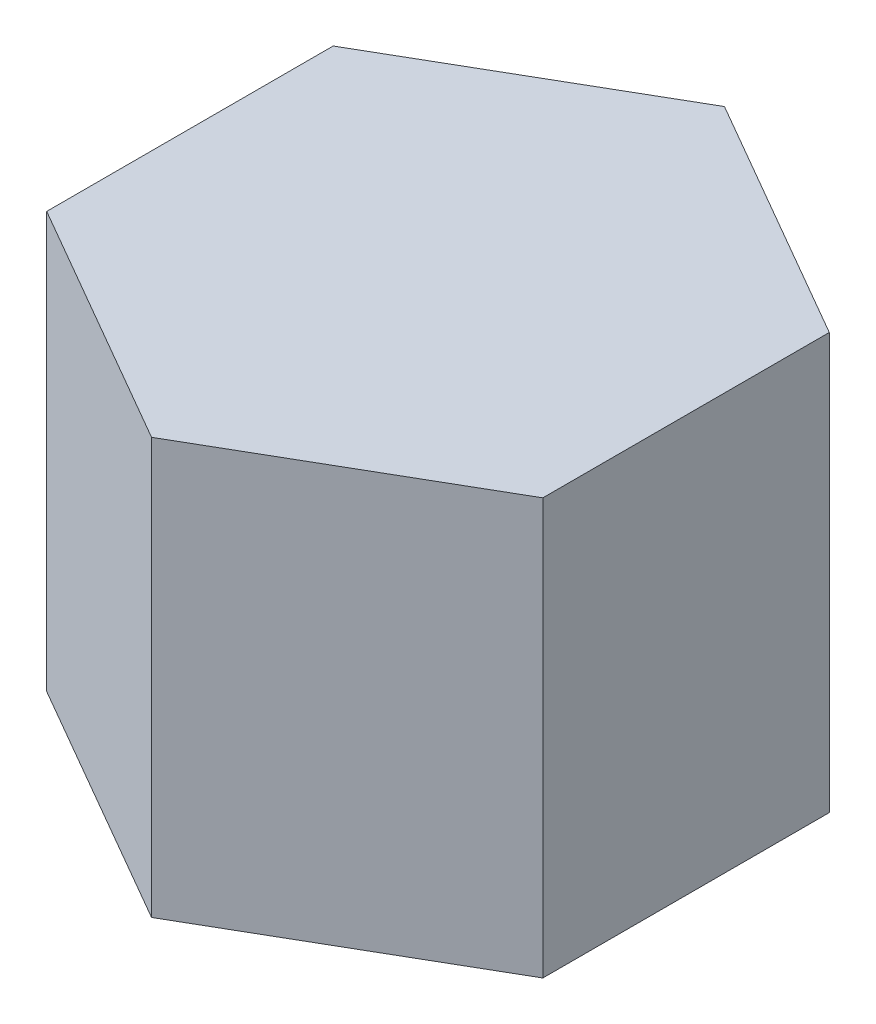
ISO-10303-21;
HEADER;
FILE_DESCRIPTION(('STEP AP214'),'2;1');
FILE_NAME('part.step','',(''),(''),'','','');
FILE_SCHEMA(('AUTOMOTIVE_DESIGN { 1 0 10303 214 1 1 1 1 }'));
ENDSEC;
DATA;
#1=APPLICATION_CONTEXT('core data for automotive mechanical design processes');
#2=APPLICATION_PROTOCOL_DEFINITION('international standard','automotive_design',2000,#1);
#3=PRODUCT_CONTEXT('',#1,'mechanical');
#4=PRODUCT('Part','Part','',(#3));
#5=PRODUCT_RELATED_PRODUCT_CATEGORY('part','',(#4));
#6=PRODUCT_DEFINITION_FORMATION('','',#4);
#7=PRODUCT_DEFINITION_CONTEXT('part definition',#1,'design');
#8=PRODUCT_DEFINITION('design','',#6,#7);
#9=PRODUCT_DEFINITION_SHAPE('','',#8);
#10=(LENGTH_UNIT() NAMED_UNIT(*) SI_UNIT(.MILLI.,.METRE.));
#11=(NAMED_UNIT(*) PLANE_ANGLE_UNIT() SI_UNIT($,.RADIAN.));
#12=(NAMED_UNIT(*) SI_UNIT($,.STERADIAN.) SOLID_ANGLE_UNIT());
#13=UNCERTAINTY_MEASURE_WITH_UNIT(LENGTH_MEASURE(1.E-05),#10,'distance_accuracy_value','');
#14=(GEOMETRIC_REPRESENTATION_CONTEXT(3) GLOBAL_UNCERTAINTY_ASSIGNED_CONTEXT((#13)) GLOBAL_UNIT_ASSIGNED_CONTEXT((#10,
#11,#12)) REPRESENTATION_CONTEXT('',''));
#15=CARTESIAN_POINT('',(0.,0.,0.));
#16=DIRECTION('',(0.,0.,1.));
#17=DIRECTION('',(1.,0.,0.));
#18=AXIS2_PLACEMENT_3D('',#15,#16,#17);
#19=CARTESIAN_POINT('',(206.142660308706,-148.537700895744,292.372996624279));
#20=DIRECTION('',(-0.499999999999909,0.,-0.866025403784491));
#21=DIRECTION('',(-0.866025403784491,0.,0.499999999999909));
#22=AXIS2_PLACEMENT_3D('',#19,#20,#21);
#23=PLANE('',#22);
#24=CARTESIAN_POINT('',(205.839551417382,-149.045793579175,292.547996624279));
#25=DIRECTION('',(0.866025403784491,0.,-0.499999999999909));
#26=VECTOR('',#25,1.);
#27=LINE('',#24,#26);
#28=CARTESIAN_POINT('',(205.839551417382,-149.045793579175,292.547996624279));
#29=VERTEX_POINT('',#28);
#30=CARTESIAN_POINT('',(206.142660308706,-149.045793579175,292.372996624279));
#31=VERTEX_POINT('',#30);
#32=EDGE_CURVE('E170',#29,#31,#27,.T.);
#33=ORIENTED_EDGE('',*,*,#32,.T.);
#34=CARTESIAN_POINT('',(206.142660308706,-148.537700895744,292.372996624279));
#35=DIRECTION('',(0.,-1.,0.));
#36=VECTOR('',#35,1.);
#37=LINE('',#34,#36);
#38=CARTESIAN_POINT('',(206.142660308706,-148.537700895744,292.372996624279));
#39=VERTEX_POINT('',#38);
#40=EDGE_CURVE('E35',#39,#31,#37,.T.);
#41=ORIENTED_EDGE('',*,*,#40,.F.);
#42=CARTESIAN_POINT('',(205.839551417382,-148.537700895744,292.547996624279));
#43=DIRECTION('',(0.866025403784491,0.,-0.499999999999909));
#44=VECTOR('',#43,1.);
#45=LINE('',#42,#44);
#46=CARTESIAN_POINT('',(205.839551417382,-148.537700895744,292.547996624279));
#47=VERTEX_POINT('',#46);
#48=EDGE_CURVE('E159',#47,#39,#45,.T.);
#49=ORIENTED_EDGE('',*,*,#48,.F.);
#50=CARTESIAN_POINT('',(205.839551417382,-148.537700895744,292.547996624279));
#51=DIRECTION('',(0.,-1.,0.));
#52=VECTOR('',#51,1.);
#53=LINE('',#50,#52);
#54=EDGE_CURVE('E10',#47,#29,#53,.T.);
#55=ORIENTED_EDGE('',*,*,#54,.T.);
#56=EDGE_LOOP('',(#33,#41,#49,#55));
#57=FACE_BOUND('',#56,.T.);
#58=ADVANCED_FACE('F16',(#57),#23,.F.);
#59=CARTESIAN_POINT('',(205.839551417382,-148.537700895744,292.547996624279));
#60=DIRECTION('',(0.500000000000062,0.,-0.866025403784403));
#61=DIRECTION('',(-0.866025403784403,0.,-0.500000000000062));
#62=AXIS2_PLACEMENT_3D('',#59,#60,#61);
#63=PLANE('',#62);
#64=CARTESIAN_POINT('',(205.536442526057,-149.045793579175,292.372996624279));
#65=DIRECTION('',(0.866025403784403,0.,0.500000000000062));
#66=VECTOR('',#65,1.);
#67=LINE('',#64,#66);
#68=CARTESIAN_POINT('',(205.536442526057,-149.045793579175,292.372996624279));
#69=VERTEX_POINT('',#68);
#70=EDGE_CURVE('E167',#69,#29,#67,.T.);
#71=ORIENTED_EDGE('',*,*,#70,.T.);
#72=ORIENTED_EDGE('',*,*,#54,.F.);
#73=CARTESIAN_POINT('',(205.536442526057,-148.537700895744,292.372996624279));
#74=DIRECTION('',(0.866025403784403,0.,0.500000000000062));
#75=VECTOR('',#74,1.);
#76=LINE('',#73,#75);
#77=CARTESIAN_POINT('',(205.536442526057,-148.537700895744,292.372996624279));
#78=VERTEX_POINT('',#77);
#79=EDGE_CURVE('E156',#78,#47,#76,.T.);
#80=ORIENTED_EDGE('',*,*,#79,.F.);
#81=CARTESIAN_POINT('',(205.536442526057,-148.537700895744,292.372996624279));
#82=DIRECTION('',(0.,-1.,0.));
#83=VECTOR('',#82,1.);
#84=LINE('',#81,#83);
#85=EDGE_CURVE('E27',#78,#69,#84,.T.);
#86=ORIENTED_EDGE('',*,*,#85,.T.);
#87=EDGE_LOOP('',(#71,#72,#80,#86));
#88=FACE_BOUND('',#87,.T.);
#89=ADVANCED_FACE('F189',(#88),#63,.F.);
#90=CARTESIAN_POINT('',(205.536442526057,-148.537700895744,290.831971220494));
#91=DIRECTION('',(1.,0.,0.));
#92=DIRECTION('',(0.,1.,0.));
#93=AXIS2_PLACEMENT_3D('',#90,#91,#92);
#94=PLANE('',#93);
#95=CARTESIAN_POINT('',(205.536442526057,-149.045793579175,292.022996624279));
#96=DIRECTION('',(0.,0.,1.));
#97=VECTOR('',#96,1.);
#98=LINE('',#95,#97);
#99=CARTESIAN_POINT('',(205.536442526057,-149.045793579175,292.022996624279));
#100=VERTEX_POINT('',#99);
#101=EDGE_CURVE('E163',#100,#69,#98,.T.);
#102=ORIENTED_EDGE('',*,*,#101,.T.);
#103=ORIENTED_EDGE('',*,*,#85,.F.);
#104=CARTESIAN_POINT('',(205.536442526057,-148.537700895744,292.022996624279));
#105=DIRECTION('',(0.,0.,1.));
#106=VECTOR('',#105,1.);
#107=LINE('',#104,#106);
#108=CARTESIAN_POINT('',(205.536442526057,-148.537700895744,292.022996624279));
#109=VERTEX_POINT('',#108);
#110=EDGE_CURVE('E106',#109,#78,#107,.T.);
#111=ORIENTED_EDGE('',*,*,#110,.F.);
#112=CARTESIAN_POINT('',(205.536442526057,-148.537700895744,292.022996624279));
#113=DIRECTION('',(0.,-1.,0.));
#114=VECTOR('',#113,1.);
#115=LINE('',#112,#114);
#116=EDGE_CURVE('E94',#109,#100,#115,.T.);
#117=ORIENTED_EDGE('',*,*,#116,.T.);
#118=EDGE_LOOP('',(#102,#103,#111,#117));
#119=FACE_BOUND('',#118,.T.);
#120=ADVANCED_FACE('F198',(#119),#94,.F.);
#121=CARTESIAN_POINT('',(205.536442526057,-148.537700895744,292.022996624279));
#122=DIRECTION('',(0.499999999999943,0.,0.866025403784472));
#123=DIRECTION('',(0.866025403784472,0.,-0.499999999999943));
#124=AXIS2_PLACEMENT_3D('',#121,#122,#123);
#125=PLANE('',#124);
#126=CARTESIAN_POINT('',(205.839551417382,-149.045793579175,291.847996624279));
#127=DIRECTION('',(-0.866025403784471,0.,0.499999999999943));
#128=VECTOR('',#127,1.);
#129=LINE('',#126,#128);
#130=CARTESIAN_POINT('',(205.839551417382,-149.045793579175,291.847996624279));
#131=VERTEX_POINT('',#130);
#132=EDGE_CURVE('E162',#131,#100,#129,.T.);
#133=ORIENTED_EDGE('',*,*,#132,.T.);
#134=ORIENTED_EDGE('',*,*,#116,.F.);
#135=CARTESIAN_POINT('',(205.839551417382,-148.537700895744,291.847996624279));
#136=DIRECTION('',(-0.866025403784471,0.,0.499999999999943));
#137=VECTOR('',#136,1.);
#138=LINE('',#135,#137);
#139=CARTESIAN_POINT('',(205.839551417382,-148.537700895744,291.847996624279));
#140=VERTEX_POINT('',#139);
#141=EDGE_CURVE('E98',#140,#109,#138,.T.);
#142=ORIENTED_EDGE('',*,*,#141,.F.);
#143=CARTESIAN_POINT('',(205.839551417382,-148.537700895744,291.847996624279));
#144=DIRECTION('',(0.,-1.,0.));
#145=VECTOR('',#144,1.);
#146=LINE('',#143,#145);
#147=EDGE_CURVE('E79',#140,#131,#146,.T.);
#148=ORIENTED_EDGE('',*,*,#147,.T.);
#149=EDGE_LOOP('',(#133,#134,#142,#148));
#150=FACE_BOUND('',#149,.T.);
#151=ADVANCED_FACE('F100',(#150),#125,.F.);
#152=CARTESIAN_POINT('',(205.839551417382,-148.537700895744,291.847996624279));
#153=DIRECTION('',(-0.500000000000096,0.,0.866025403784383));
#154=DIRECTION('',(0.866025403784383,0.,0.500000000000096));
#155=AXIS2_PLACEMENT_3D('',#152,#153,#154);
#156=PLANE('',#155);
#157=CARTESIAN_POINT('',(206.142660308706,-149.045793579175,292.022996624279));
#158=DIRECTION('',(-0.866025403784383,0.,-0.500000000000096));
#159=VECTOR('',#158,1.);
#160=LINE('',#157,#159);
#161=CARTESIAN_POINT('',(206.142660308706,-149.045793579175,292.022996624279));
#162=VERTEX_POINT('',#161);
#163=EDGE_CURVE('E88',#162,#131,#160,.T.);
#164=ORIENTED_EDGE('',*,*,#163,.T.);
#165=ORIENTED_EDGE('',*,*,#147,.F.);
#166=CARTESIAN_POINT('',(206.142660308706,-148.537700895744,292.022996624279));
#167=DIRECTION('',(-0.866025403784383,0.,-0.500000000000096));
#168=VECTOR('',#167,1.);
#169=LINE('',#166,#168);
#170=CARTESIAN_POINT('',(206.142660308706,-148.537700895744,292.022996624279));
#171=VERTEX_POINT('',#170);
#172=EDGE_CURVE('E84',#171,#140,#169,.T.);
#173=ORIENTED_EDGE('',*,*,#172,.F.);
#174=CARTESIAN_POINT('',(206.142660308706,-148.537700895744,292.022996624279));
#175=DIRECTION('',(0.,-1.,0.));
#176=VECTOR('',#175,1.);
#177=LINE('',#174,#176);
#178=EDGE_CURVE('E58',#171,#162,#177,.T.);
#179=ORIENTED_EDGE('',*,*,#178,.T.);
#180=EDGE_LOOP('',(#164,#165,#173,#179));
#181=FACE_BOUND('',#180,.T.);
#182=ADVANCED_FACE('F82',(#181),#156,.F.);
#183=CARTESIAN_POINT('',(206.142660308706,-148.537700895744,290.831971220494));
#184=DIRECTION('',(-1.,0.,0.));
#185=DIRECTION('',(0.,-1.,0.));
#186=AXIS2_PLACEMENT_3D('',#183,#184,#185);
#187=PLANE('',#186);
#188=CARTESIAN_POINT('',(206.142660308706,-149.045793579175,292.372996624279));
#189=DIRECTION('',(0.,0.,-1.));
#190=VECTOR('',#189,1.);
#191=LINE('',#188,#190);
#192=EDGE_CURVE('E160',#31,#162,#191,.T.);
#193=ORIENTED_EDGE('',*,*,#192,.T.);
#194=ORIENTED_EDGE('',*,*,#178,.F.);
#195=CARTESIAN_POINT('',(206.142660308706,-148.537700895744,292.372996624279));
#196=DIRECTION('',(0.,0.,-1.));
#197=VECTOR('',#196,1.);
#198=LINE('',#195,#197);
#199=EDGE_CURVE('E112',#39,#171,#198,.T.);
#200=ORIENTED_EDGE('',*,*,#199,.F.);
#201=ORIENTED_EDGE('',*,*,#40,.T.);
#202=EDGE_LOOP('',(#193,#194,#200,#201));
#203=FACE_BOUND('',#202,.T.);
#204=ADVANCED_FACE('F131',(#203),#187,.F.);
#205=CARTESIAN_POINT('',(206.339551417382,-148.537700895744,290.831971220494));
#206=DIRECTION('',(0.,-1.,0.));
#207=DIRECTION('',(1.,0.,0.));
#208=AXIS2_PLACEMENT_3D('',#205,#206,#207);
#209=PLANE('',#208);
#210=ORIENTED_EDGE('',*,*,#48,.T.);
#211=ORIENTED_EDGE('',*,*,#199,.T.);
#212=ORIENTED_EDGE('',*,*,#172,.T.);
#213=ORIENTED_EDGE('',*,*,#141,.T.);
#214=ORIENTED_EDGE('',*,*,#110,.T.);
#215=ORIENTED_EDGE('',*,*,#79,.T.);
#216=EDGE_LOOP('',(#210,#211,#212,#213,#214,#215));
#217=FACE_BOUND('',#216,.T.);
#218=ADVANCED_FACE('F111',(#217),#209,.F.);
#219=CARTESIAN_POINT('',(206.339551417382,-149.045793579175,290.831971220494));
#220=DIRECTION('',(0.,-1.,0.));
#221=DIRECTION('',(1.,0.,0.));
#222=AXIS2_PLACEMENT_3D('',#219,#220,#221);
#223=PLANE('',#222);
#224=ORIENTED_EDGE('',*,*,#32,.F.);
#225=ORIENTED_EDGE('',*,*,#70,.F.);
#226=ORIENTED_EDGE('',*,*,#101,.F.);
#227=ORIENTED_EDGE('',*,*,#132,.F.);
#228=ORIENTED_EDGE('',*,*,#163,.F.);
#229=ORIENTED_EDGE('',*,*,#192,.F.);
#230=EDGE_LOOP('',(#224,#225,#226,#227,#228,#229));
#231=FACE_BOUND('',#230,.T.);
#232=ADVANCED_FACE('F130',(#231),#223,.T.);
#233=CLOSED_SHELL('',(#58,#89,#120,#151,#182,#204,#218,#232));
#234=MANIFOLD_SOLID_BREP('B1',#233);
#235=ADVANCED_BREP_SHAPE_REPRESENTATION('',(#18,#234),#14);
#236=SHAPE_DEFINITION_REPRESENTATION(#9,#235);
ENDSEC;
END-ISO-10303-21;
